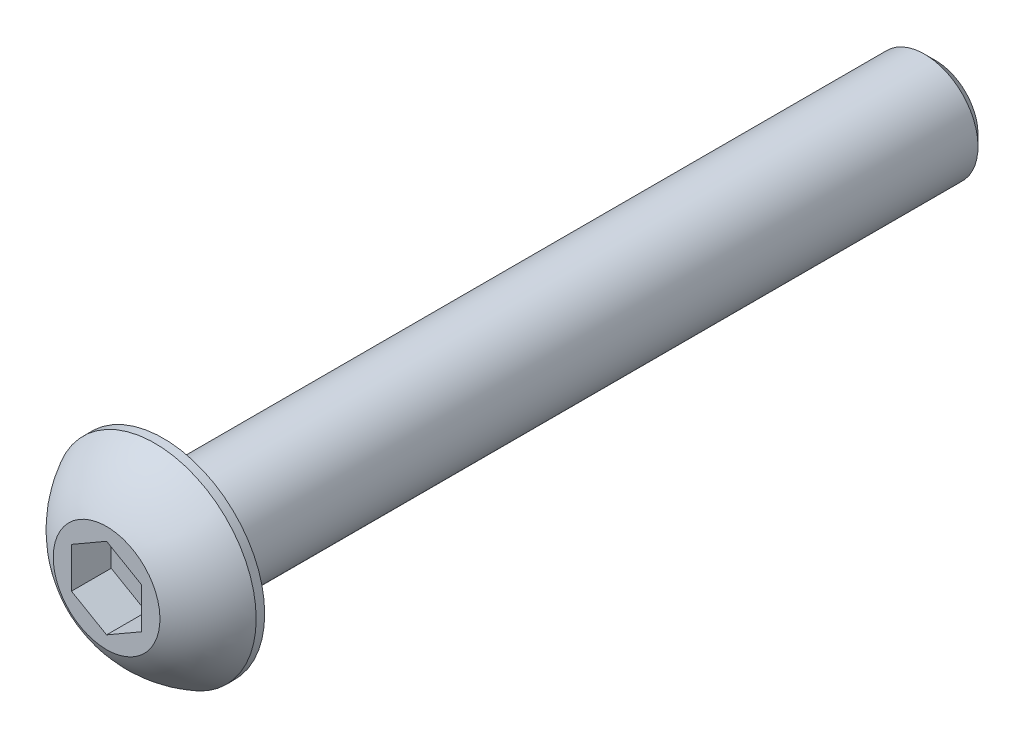
ISO-10303-21;
HEADER;
FILE_DESCRIPTION(('STEP AP214'),'2;1');
FILE_NAME('part.step','',(''),(''),'','','');
FILE_SCHEMA(('AUTOMOTIVE_DESIGN { 1 0 10303 214 1 1 1 1 }'));
ENDSEC;
DATA;
#1=APPLICATION_CONTEXT('core data for automotive mechanical design processes');
#2=APPLICATION_PROTOCOL_DEFINITION('international standard','automotive_design',2000,#1);
#3=PRODUCT_CONTEXT('',#1,'mechanical');
#4=PRODUCT('Part','Part','',(#3));
#5=PRODUCT_RELATED_PRODUCT_CATEGORY('part','',(#4));
#6=PRODUCT_DEFINITION_FORMATION('','',#4);
#7=PRODUCT_DEFINITION_CONTEXT('part definition',#1,'design');
#8=PRODUCT_DEFINITION('design','',#6,#7);
#9=PRODUCT_DEFINITION_SHAPE('','',#8);
#10=(LENGTH_UNIT() NAMED_UNIT(*) SI_UNIT(.MILLI.,.METRE.));
#11=(NAMED_UNIT(*) PLANE_ANGLE_UNIT() SI_UNIT($,.RADIAN.));
#12=(NAMED_UNIT(*) SI_UNIT($,.STERADIAN.) SOLID_ANGLE_UNIT());
#13=UNCERTAINTY_MEASURE_WITH_UNIT(LENGTH_MEASURE(1.E-05),#10,'distance_accuracy_value','');
#14=(GEOMETRIC_REPRESENTATION_CONTEXT(3) GLOBAL_UNCERTAINTY_ASSIGNED_CONTEXT((#13)) GLOBAL_UNIT_ASSIGNED_CONTEXT((#10,
#11,#12)) REPRESENTATION_CONTEXT('',''));
#15=CARTESIAN_POINT('',(0.,0.,0.));
#16=DIRECTION('',(0.,0.,1.));
#17=DIRECTION('',(1.,0.,0.));
#18=AXIS2_PLACEMENT_3D('',#15,#16,#17);
#19=CARTESIAN_POINT('',(0.,0.,-4.57488061444379));
#20=DIRECTION('',(0.,0.,1.));
#21=DIRECTION('',(0.,-1.,0.));
#22=AXIS2_PLACEMENT_3D('',#19,#20,#21);
#23=SPHERICAL_SURFACE('',#22,5.17224338526463);
#24=CARTESIAN_POINT('',(0.,0.,0.));
#25=DIRECTION('',(0.,0.,1.));
#26=DIRECTION('',(1.,0.,0.));
#27=AXIS2_PLACEMENT_3D('',#24,#25,#26);
#28=CIRCLE('',#27,2.41300000000001);
#29=CARTESIAN_POINT('',(0.,-2.41300000000001,0.));
#30=VERTEX_POINT('',#29);
#31=EDGE_CURVE('E12',#30,#30,#28,.T.);
#32=CARTESIAN_POINT('',(0.,0.,-2.18059));
#33=DIRECTION('',(0.,0.,1.));
#34=DIRECTION('',(1.,0.,0.));
#35=AXIS2_PLACEMENT_3D('',#32,#33,#34);
#36=CIRCLE('',#35,4.5847);
#37=CARTESIAN_POINT('',(0.,-4.5847,-2.18059));
#38=VERTEX_POINT('',#37);
#39=EDGE_CURVE('E150',#38,#38,#36,.T.);
#40=CARTESIAN_POINT('',(0.,-2.41300000000001,0.));
#41=CARTESIAN_POINT('',(0.,-2.44179113663083,-0.0151857097788006));
#42=CARTESIAN_POINT('',(0.,-2.47043888331475,-0.0306432741933341));
#43=CARTESIAN_POINT('',(0.,-2.52743746903511,-0.0620964513369402));
#44=CARTESIAN_POINT('',(0.,-2.55578830807156,-0.0780920640660127));
#45=CARTESIAN_POINT('',(0.,-2.61218295074332,-0.110615676881771));
#46=CARTESIAN_POINT('',(0.,-2.64022675437863,-0.127143676968458));
#47=CARTESIAN_POINT('',(0.,-2.69599733629139,-0.160726162390166));
#48=CARTESIAN_POINT('',(0.,-2.72372411456883,-0.177780647725189));
#49=CARTESIAN_POINT('',(0.,-2.77885076121155,-0.212410027642939));
#50=CARTESIAN_POINT('',(0.,-2.80625062957683,-0.229984922225668));
#51=CARTESIAN_POINT('',(0.,-2.86071369040083,-0.265648855453746));
#52=CARTESIAN_POINT('',(0.,-2.88777688285955,-0.283737894099096));
#53=CARTESIAN_POINT('',(0.,-2.94155694533547,-0.320423667994127));
#54=CARTESIAN_POINT('',(0.,-2.96827381535266,-0.339020403243808));
#55=CARTESIAN_POINT('',(0.,-3.0213517100001,-0.37671494166065));
#56=CARTESIAN_POINT('',(0.,-3.04771273463033,-0.39581274482781));
#57=CARTESIAN_POINT('',(0.,-3.10006954235699,-0.434502611862808));
#58=CARTESIAN_POINT('',(0.,-3.12606532545341,-0.454094675730644));
#59=CARTESIAN_POINT('',(0.,-3.17768238416297,-0.493766080756604));
#60=CARTESIAN_POINT('',(0.,-3.2033036597761,-0.513845421914727));
#61=CARTESIAN_POINT('',(0.,-3.25416257105645,-0.554484224430573));
#62=CARTESIAN_POINT('',(0.,-3.27940020672367,-0.575043685788297));
#63=CARTESIAN_POINT('',(0.,-3.32948284239518,-0.616635400476975));
#64=CARTESIAN_POINT('',(0.,-3.35432784239946,-0.63766765380793));
#65=CARTESIAN_POINT('',(0.,-3.40361635097914,-0.680197455694829));
#66=CARTESIAN_POINT('',(0.,-3.42805985955453,-0.701695004250773));
#67=CARTESIAN_POINT('',(0.,-3.47653667261837,-0.745147733989217));
#68=CARTESIAN_POINT('',(0.,-3.50056997710681,-0.767102915171717));
#69=CARTESIAN_POINT('',(0.,-3.54821781555203,-0.81146308444603));
#70=CARTESIAN_POINT('',(0.,-3.57183234950882,-0.833868072537844));
#71=CARTESIAN_POINT('',(0.,-3.61863422971284,-0.879119869584106));
#72=CARTESIAN_POINT('',(0.,-3.64182157596008,-0.901966678538555));
#73=CARTESIAN_POINT('',(0.,-3.68776081583416,-0.948093973780533));
#74=CARTESIAN_POINT('',(0.,-3.71051270946099,-0.971374460068062));
#75=CARTESIAN_POINT('',(0.,-3.75557293439636,-1.01836081186645));
#76=CARTESIAN_POINT('',(0.,-3.7778812657049,-1.0420666773773));
#77=CARTESIAN_POINT('',(0.,-3.82204641440941,-1.08989533789019));
#78=CARTESIAN_POINT('',(0.,-3.84390323180539,-1.11401813289221));
#79=CARTESIAN_POINT('',(0.,-3.88715756202836,-1.16267205404467));
#80=CARTESIAN_POINT('',(0.,-3.90855507485536,-1.18720318019511));
#81=CARTESIAN_POINT('',(0.,-3.95088316899876,-1.23666501975588));
#82=CARTESIAN_POINT('',(0.,-3.97181375031515,-1.26159573316622));
#83=CARTESIAN_POINT('',(0.,-4.01320052092912,-1.31184786092909));
#84=CARTESIAN_POINT('',(0.,-4.03365671022669,-1.33716927528163));
#85=CARTESIAN_POINT('',(0.,-4.07408740538699,-1.38819377934977));
#86=CARTESIAN_POINT('',(0.,-4.09406191124973,-1.41389686906536));
#87=CARTESIAN_POINT('',(0.,-4.13352211981722,-1.46567556223513));
#88=CARTESIAN_POINT('',(0.,-4.15300782252199,-1.4917511656893));
#89=CARTESIAN_POINT('',(0.,-4.19148347927458,-1.54426559193551));
#90=CARTESIAN_POINT('',(0.,-4.2104734333224,-1.57070441472756));
#91=CARTESIAN_POINT('',(0.,-4.24795082398615,-1.6239358557723));
#92=CARTESIAN_POINT('',(0.,-4.26643826060207,-1.65072847402499));
#93=CARTESIAN_POINT('',(0.,-4.30290402667351,-1.70465795604563));
#94=CARTESIAN_POINT('',(0.,-4.32088235612901,-1.73179481981358));
#95=CARTESIAN_POINT('',(0.,-4.35632349988304,-1.78640312007115));
#96=CARTESIAN_POINT('',(0.,-4.37378631418156,-1.81387455656079));
#97=CARTESIAN_POINT('',(0.,-4.40819020238474,-1.86914221075438));
#98=CARTESIAN_POINT('',(0.,-4.42513127628939,-1.89693842845834));
#99=CARTESIAN_POINT('',(0.,-4.45848564813517,-1.95284573578717));
#100=CARTESIAN_POINT('',(0.,-4.4748989460763,-1.98095682541204));
#101=CARTESIAN_POINT('',(0.,-4.50719190474587,-2.03748386259806));
#102=CARTESIAN_POINT('',(0.,-4.5230715654743,-2.06589981015923));
#103=CARTESIAN_POINT('',(0.,-4.55429163018258,-2.12302641242262));
#104=CARTESIAN_POINT('',(0.,-4.56963203416241,-2.15173706712485));
#105=CARTESIAN_POINT('',(0.,-4.5847,-2.18059));
#106=B_SPLINE_CURVE_WITH_KNOTS('',3,(#40,#41,#42,#43,#44,#45,#46,#47,#48,#49,#50,#51,#52,#53,
#54,#55,#56,#57,#58,#59,#60,#61,#62,#63,#64,#65,#66,#67,#68,#69,#70,#71,#72,#73,#74,#75,#76,#77,
#78,#79,#80,#81,#82,#83,#84,#85,#86,#87,#88,#89,#90,#91,#92,#93,#94,#95,#96,#97,#98,#99,#100,
#101,#102,#103,#104,#105),.UNSPECIFIED.,.F.,.F.,(4,2,2,2,2,2,2,2,2,2,2,2,2,2,2,2,2,2,2,2,2,2,2,
2,2,2,2,2,2,2,2,2,4),(0.,0.0976500604051494,0.195300120810298,0.292950181215448,
0.390600241620597,0.488250302025746,0.585900362430895,0.683550422836045,0.781200483241193,
0.878850543646342,0.976500604051491,1.07415066445664,1.17180072486179,1.26945078526694,
1.36710084567209,1.46475090607724,1.56240096648239,1.66005102688754,1.75770108729268,
1.85535114769783,1.95300120810298,2.05065126850813,2.14830132891328,2.24595138931843,
2.34360144972358,2.44125151012873,2.53890157053388,2.63655163093903,2.73420169134418,
2.83185175174933,2.92950181215447,3.02715187255962,3.12480193296477),.UNSPECIFIED.);
#107=EDGE_CURVE('BSEAM49',#30,#38,#106,.T.);
#108=ORIENTED_EDGE('',*,*,#31,.F.);
#109=ORIENTED_EDGE('',*,*,#39,.T.);
#110=ORIENTED_EDGE('',*,*,#107,.T.);
#111=ORIENTED_EDGE('',*,*,#107,.F.);
#112=EDGE_LOOP('',(#108,#110,#109,#111));
#113=FACE_BOUND('',#112,.T.);
#114=ADVANCED_FACE('F49',(#113),#23,.T.);
#115=CARTESIAN_POINT('',(0.,-2.41300000000001,0.));
#116=DIRECTION('',(0.,0.,-1.));
#117=DIRECTION('',(-1.,0.,0.));
#118=AXIS2_PLACEMENT_3D('',#115,#116,#117);
#119=PLANE('',#118);
#120=DIRECTION('',(0.,1.,0.));
#121=VECTOR('',#120,1.);
#122=CARTESIAN_POINT('',(1.5875,-0.916543552338528,0.));
#123=LINE('',#122,#121);
#124=CARTESIAN_POINT('',(1.5875,-0.916543552338528,0.));
#125=VERTEX_POINT('',#124);
#126=CARTESIAN_POINT('',(1.5875,0.916543552338531,0.));
#127=VERTEX_POINT('',#126);
#128=EDGE_CURVE('E137',#125,#127,#123,.T.);
#129=ORIENTED_EDGE('',*,*,#128,.F.);
#130=DIRECTION('',(0.866025403784438,0.5,0.));
#131=VECTOR('',#130,1.);
#132=CARTESIAN_POINT('',(0.,-1.83308710467706,0.));
#133=LINE('',#132,#131);
#134=CARTESIAN_POINT('',(0.,-1.83308710467706,0.));
#135=VERTEX_POINT('',#134);
#136=EDGE_CURVE('E63',#135,#125,#133,.T.);
#137=ORIENTED_EDGE('',*,*,#136,.F.);
#138=DIRECTION('',(0.866025403784439,-0.5,0.));
#139=VECTOR('',#138,1.);
#140=CARTESIAN_POINT('',(-1.5875,-0.916543552338531,0.));
#141=LINE('',#140,#139);
#142=CARTESIAN_POINT('',(-1.5875,-0.916543552338531,0.));
#143=VERTEX_POINT('',#142);
#144=EDGE_CURVE('E146',#143,#135,#141,.T.);
#145=ORIENTED_EDGE('',*,*,#144,.F.);
#146=DIRECTION('',(0.,-1.,0.));
#147=VECTOR('',#146,1.);
#148=CARTESIAN_POINT('',(-1.5875,0.91654355233853,0.));
#149=LINE('',#148,#147);
#150=CARTESIAN_POINT('',(-1.5875,0.91654355233853,0.));
#151=VERTEX_POINT('',#150);
#152=EDGE_CURVE('E144',#151,#143,#149,.T.);
#153=ORIENTED_EDGE('',*,*,#152,.F.);
#154=DIRECTION('',(-0.866025403784439,-0.5,0.));
#155=VECTOR('',#154,1.);
#156=CARTESIAN_POINT('',(0.,1.83308710467706,0.));
#157=LINE('',#156,#155);
#158=CARTESIAN_POINT('',(0.,1.83308710467706,0.));
#159=VERTEX_POINT('',#158);
#160=EDGE_CURVE('E111',#159,#151,#157,.T.);
#161=ORIENTED_EDGE('',*,*,#160,.F.);
#162=DIRECTION('',(-0.866025403784439,0.5,0.));
#163=VECTOR('',#162,1.);
#164=CARTESIAN_POINT('',(1.5875,0.916543552338531,0.));
#165=LINE('',#164,#163);
#166=EDGE_CURVE('E140',#127,#159,#165,.T.);
#167=ORIENTED_EDGE('',*,*,#166,.F.);
#168=EDGE_LOOP('',(#129,#137,#145,#153,#161,#167));
#169=FACE_BOUND('',#168,.T.);
#170=ORIENTED_EDGE('',*,*,#31,.T.);
#171=EDGE_LOOP('',(#170));
#172=FACE_BOUND('',#171,.T.);
#173=ADVANCED_FACE('F164',(#169,#172),#119,.F.);
#174=CARTESIAN_POINT('',(0.,-4.5847,-2.5654));
#175=DIRECTION('',(0.,0.,1.));
#176=DIRECTION('',(1.,0.,0.));
#177=AXIS2_PLACEMENT_3D('',#174,#175,#176);
#178=PLANE('',#177);
#179=CARTESIAN_POINT('',(0.,0.,-2.5654));
#180=DIRECTION('',(0.,0.,1.));
#181=DIRECTION('',(1.,0.,0.));
#182=AXIS2_PLACEMENT_3D('',#179,#180,#181);
#183=CIRCLE('',#182,4.5847);
#184=CARTESIAN_POINT('',(4.5847,0.,-2.5654));
#185=VERTEX_POINT('',#184);
#186=EDGE_CURVE('E56',#185,#185,#183,.T.);
#187=ORIENTED_EDGE('',*,*,#186,.F.);
#188=EDGE_LOOP('',(#187));
#189=FACE_BOUND('',#188,.T.);
#190=ADVANCED_FACE('F162',(#189),#178,.F.);
#191=CARTESIAN_POINT('',(0.,0.,0.));
#192=DIRECTION('',(0.,0.,1.));
#193=DIRECTION('',(1.,0.,0.));
#194=AXIS2_PLACEMENT_3D('',#191,#192,#193);
#195=CYLINDRICAL_SURFACE('',#194,4.5847);
#196=ORIENTED_EDGE('',*,*,#39,.F.);
#197=EDGE_LOOP('',(#196));
#198=FACE_BOUND('',#197,.T.);
#199=ORIENTED_EDGE('',*,*,#186,.T.);
#200=EDGE_LOOP('',(#199));
#201=FACE_BOUND('',#200,.T.);
#202=ADVANCED_FACE('F160',(#198,#201),#195,.T.);
#203=CARTESIAN_POINT('',(0.,-1.83308710467706,-1.79578));
#204=DIRECTION('',(0.5,-0.866025403784438,0.));
#205=DIRECTION('',(0.866025403784438,0.5,0.));
#206=AXIS2_PLACEMENT_3D('',#203,#204,#205);
#207=PLANE('',#206);
#208=ORIENTED_EDGE('',*,*,#136,.T.);
#209=DIRECTION('',(0.,0.,1.));
#210=VECTOR('',#209,1.);
#211=CARTESIAN_POINT('',(1.5875,-0.916543552338528,-1.79578));
#212=LINE('',#211,#210);
#213=CARTESIAN_POINT('',(1.5875,-0.916543552338528,-1.79578));
#214=VERTEX_POINT('',#213);
#215=EDGE_CURVE('E93',#214,#125,#212,.T.);
#216=ORIENTED_EDGE('',*,*,#215,.F.);
#217=DIRECTION('',(0.866025403784438,0.5,0.));
#218=VECTOR('',#217,1.);
#219=CARTESIAN_POINT('',(0.,-1.83308710467706,-1.79578));
#220=LINE('',#219,#218);
#221=CARTESIAN_POINT('',(0.,-1.83308710467706,-1.79578));
#222=VERTEX_POINT('',#221);
#223=EDGE_CURVE('E148',#222,#214,#220,.T.);
#224=ORIENTED_EDGE('',*,*,#223,.F.);
#225=DIRECTION('',(0.,0.,1.));
#226=VECTOR('',#225,1.);
#227=CARTESIAN_POINT('',(0.,-1.83308710467706,-1.79578));
#228=LINE('',#227,#226);
#229=EDGE_CURVE('E71',#222,#135,#228,.T.);
#230=ORIENTED_EDGE('',*,*,#229,.T.);
#231=EDGE_LOOP('',(#208,#216,#224,#230));
#232=FACE_BOUND('',#231,.T.);
#233=ADVANCED_FACE('F170',(#232),#207,.F.);
#234=CARTESIAN_POINT('',(-1.5875,-0.916543552338531,-1.79578));
#235=DIRECTION('',(-0.5,-0.866025403784439,0.));
#236=DIRECTION('',(0.866025403784439,-0.5,0.));
#237=AXIS2_PLACEMENT_3D('',#234,#235,#236);
#238=PLANE('',#237);
#239=ORIENTED_EDGE('',*,*,#144,.T.);
#240=ORIENTED_EDGE('',*,*,#229,.F.);
#241=DIRECTION('',(0.866025403784439,-0.5,0.));
#242=VECTOR('',#241,1.);
#243=CARTESIAN_POINT('',(-1.5875,-0.916543552338531,-1.79578));
#244=LINE('',#243,#242);
#245=CARTESIAN_POINT('',(-1.5875,-0.916543552338531,-1.79578));
#246=VERTEX_POINT('',#245);
#247=EDGE_CURVE('E123',#246,#222,#244,.T.);
#248=ORIENTED_EDGE('',*,*,#247,.F.);
#249=DIRECTION('',(0.,0.,1.));
#250=VECTOR('',#249,1.);
#251=CARTESIAN_POINT('',(-1.5875,-0.916543552338531,-1.79578));
#252=LINE('',#251,#250);
#253=EDGE_CURVE('E115',#246,#143,#252,.T.);
#254=ORIENTED_EDGE('',*,*,#253,.T.);
#255=EDGE_LOOP('',(#239,#240,#248,#254));
#256=FACE_BOUND('',#255,.T.);
#257=ADVANCED_FACE('F199',(#256),#238,.F.);
#258=CARTESIAN_POINT('',(-1.5875,0.91654355233853,-1.79578));
#259=DIRECTION('',(-1.,0.,0.));
#260=DIRECTION('',(0.,-1.,0.));
#261=AXIS2_PLACEMENT_3D('',#258,#259,#260);
#262=PLANE('',#261);
#263=ORIENTED_EDGE('',*,*,#152,.T.);
#264=ORIENTED_EDGE('',*,*,#253,.F.);
#265=DIRECTION('',(0.,-1.,0.));
#266=VECTOR('',#265,1.);
#267=CARTESIAN_POINT('',(-1.5875,0.91654355233853,-1.79578));
#268=LINE('',#267,#266);
#269=CARTESIAN_POINT('',(-1.5875,0.91654355233853,-1.79578));
#270=VERTEX_POINT('',#269);
#271=EDGE_CURVE('E119',#270,#246,#268,.T.);
#272=ORIENTED_EDGE('',*,*,#271,.F.);
#273=DIRECTION('',(0.,0.,1.));
#274=VECTOR('',#273,1.);
#275=CARTESIAN_POINT('',(-1.5875,0.91654355233853,-1.79578));
#276=LINE('',#275,#274);
#277=EDGE_CURVE('E104',#270,#151,#276,.T.);
#278=ORIENTED_EDGE('',*,*,#277,.T.);
#279=EDGE_LOOP('',(#263,#264,#272,#278));
#280=FACE_BOUND('',#279,.T.);
#281=ADVANCED_FACE('F120',(#280),#262,.F.);
#282=CARTESIAN_POINT('',(0.,1.83308710467706,-1.79578));
#283=DIRECTION('',(-0.5,0.866025403784439,0.));
#284=DIRECTION('',(-0.866025403784439,-0.5,0.));
#285=AXIS2_PLACEMENT_3D('',#282,#283,#284);
#286=PLANE('',#285);
#287=ORIENTED_EDGE('',*,*,#160,.T.);
#288=ORIENTED_EDGE('',*,*,#277,.F.);
#289=DIRECTION('',(-0.866025403784439,-0.5,0.));
#290=VECTOR('',#289,1.);
#291=CARTESIAN_POINT('',(0.,1.83308710467706,-1.79578));
#292=LINE('',#291,#290);
#293=CARTESIAN_POINT('',(0.,1.83308710467706,-1.79578));
#294=VERTEX_POINT('',#293);
#295=EDGE_CURVE('E108',#294,#270,#292,.T.);
#296=ORIENTED_EDGE('',*,*,#295,.F.);
#297=DIRECTION('',(0.,0.,1.));
#298=VECTOR('',#297,1.);
#299=CARTESIAN_POINT('',(0.,1.83308710467706,-1.79578));
#300=LINE('',#299,#298);
#301=EDGE_CURVE('E116',#294,#159,#300,.T.);
#302=ORIENTED_EDGE('',*,*,#301,.T.);
#303=EDGE_LOOP('',(#287,#288,#296,#302));
#304=FACE_BOUND('',#303,.T.);
#305=ADVANCED_FACE('F106',(#304),#286,.F.);
#306=CARTESIAN_POINT('',(1.5875,0.916543552338531,-1.79578));
#307=DIRECTION('',(0.5,0.866025403784439,0.));
#308=DIRECTION('',(-0.866025403784439,0.5,0.));
#309=AXIS2_PLACEMENT_3D('',#306,#307,#308);
#310=PLANE('',#309);
#311=ORIENTED_EDGE('',*,*,#166,.T.);
#312=ORIENTED_EDGE('',*,*,#301,.F.);
#313=DIRECTION('',(-0.866025403784439,0.5,0.));
#314=VECTOR('',#313,1.);
#315=CARTESIAN_POINT('',(1.5875,0.916543552338531,-1.79578));
#316=LINE('',#315,#314);
#317=CARTESIAN_POINT('',(1.5875,0.916543552338531,-1.79578));
#318=VERTEX_POINT('',#317);
#319=EDGE_CURVE('E129',#318,#294,#316,.T.);
#320=ORIENTED_EDGE('',*,*,#319,.F.);
#321=DIRECTION('',(0.,0.,1.));
#322=VECTOR('',#321,1.);
#323=CARTESIAN_POINT('',(1.5875,0.916543552338531,-1.79578));
#324=LINE('',#323,#322);
#325=EDGE_CURVE('E153',#318,#127,#324,.T.);
#326=ORIENTED_EDGE('',*,*,#325,.T.);
#327=EDGE_LOOP('',(#311,#312,#320,#326));
#328=FACE_BOUND('',#327,.T.);
#329=ADVANCED_FACE('F224',(#328),#310,.F.);
#330=CARTESIAN_POINT('',(1.5875,-0.916543552338528,-1.79578));
#331=DIRECTION('',(1.,0.,0.));
#332=DIRECTION('',(0.,1.,0.));
#333=AXIS2_PLACEMENT_3D('',#330,#331,#332);
#334=PLANE('',#333);
#335=ORIENTED_EDGE('',*,*,#128,.T.);
#336=ORIENTED_EDGE('',*,*,#325,.F.);
#337=DIRECTION('',(0.,1.,0.));
#338=VECTOR('',#337,1.);
#339=CARTESIAN_POINT('',(1.5875,-0.916543552338528,-1.79578));
#340=LINE('',#339,#338);
#341=EDGE_CURVE('E131',#214,#318,#340,.T.);
#342=ORIENTED_EDGE('',*,*,#341,.F.);
#343=ORIENTED_EDGE('',*,*,#215,.T.);
#344=EDGE_LOOP('',(#335,#336,#342,#343));
#345=FACE_BOUND('',#344,.T.);
#346=ADVANCED_FACE('F233',(#345),#334,.F.);
#347=CARTESIAN_POINT('',(1.5875,-0.916543552338528,-1.79578));
#348=DIRECTION('',(0.,0.,1.));
#349=DIRECTION('',(1.,0.,0.));
#350=AXIS2_PLACEMENT_3D('',#347,#348,#349);
#351=PLANE('',#350);
#352=ORIENTED_EDGE('',*,*,#223,.T.);
#353=ORIENTED_EDGE('',*,*,#341,.T.);
#354=ORIENTED_EDGE('',*,*,#319,.T.);
#355=ORIENTED_EDGE('',*,*,#295,.T.);
#356=ORIENTED_EDGE('',*,*,#271,.T.);
#357=ORIENTED_EDGE('',*,*,#247,.T.);
#358=EDGE_LOOP('',(#352,#353,#354,#355,#356,#357));
#359=FACE_BOUND('',#358,.T.);
#360=ADVANCED_FACE('F126',(#359),#351,.T.);
#361=CLOSED_SHELL('',(#114,#173,#190,#202,#233,#257,#281,#305,#329,#346,#360));
#362=MANIFOLD_SOLID_BREP('B2',#361);
#363=CARTESIAN_POINT('',(0.,2.41300000000001,-37.4904));
#364=DIRECTION('',(0.,0.,1.));
#365=DIRECTION('',(0.,-1.,0.));
#366=AXIS2_PLACEMENT_3D('',#363,#364,#365);
#367=PLANE('',#366);
#368=CARTESIAN_POINT('',(0.,0.,-37.4904));
#369=DIRECTION('',(0.,0.,1.));
#370=DIRECTION('',(0.,-1.,0.));
#371=AXIS2_PLACEMENT_3D('',#368,#369,#370);
#372=CIRCLE('',#371,1.91690625000002);
#373=CARTESIAN_POINT('',(0.,-1.91690625000003,-37.4904));
#374=VERTEX_POINT('',#373);
#375=EDGE_CURVE('E48',#374,#374,#372,.F.);
#376=ORIENTED_EDGE('',*,*,#375,.T.);
#377=EDGE_LOOP('',(#376));
#378=FACE_BOUND('',#377,.T.);
#379=ADVANCED_FACE('F270',(#378),#367,.F.);
#380=CARTESIAN_POINT('',(0.,0.,-2.5654));
#381=DIRECTION('',(0.,0.,1.));
#382=DIRECTION('',(0.,-1.,0.));
#383=AXIS2_PLACEMENT_3D('',#380,#381,#382);
#384=CYLINDRICAL_SURFACE('',#383,2.41300000000001);
#385=CARTESIAN_POINT('',(0.,0.,-36.99430625));
#386=DIRECTION('',(0.,0.,1.));
#387=DIRECTION('',(0.,-1.,0.));
#388=AXIS2_PLACEMENT_3D('',#385,#386,#387);
#389=CIRCLE('',#388,2.41300000000001);
#390=CARTESIAN_POINT('',(0.,-2.41300000000002,-36.99430625));
#391=VERTEX_POINT('',#390);
#392=EDGE_CURVE('E278',#391,#391,#389,.T.);
#393=ORIENTED_EDGE('',*,*,#392,.T.);
#394=EDGE_LOOP('',(#393));
#395=FACE_BOUND('',#394,.T.);
#396=CARTESIAN_POINT('',(0.,0.,-2.5654));
#397=DIRECTION('',(0.,0.,1.));
#398=DIRECTION('',(0.,-1.,0.));
#399=AXIS2_PLACEMENT_3D('',#396,#397,#398);
#400=CIRCLE('',#399,2.41300000000001);
#401=CARTESIAN_POINT('',(0.,-2.41300000000001,-2.5654));
#402=VERTEX_POINT('',#401);
#403=EDGE_CURVE('E283',#402,#402,#400,.T.);
#404=ORIENTED_EDGE('',*,*,#403,.F.);
#405=EDGE_LOOP('',(#404));
#406=FACE_BOUND('',#405,.T.);
#407=ADVANCED_FACE('F293',(#395,#406),#384,.T.);
#408=CARTESIAN_POINT('',(0.,2.41300000000001,-2.5654));
#409=DIRECTION('',(0.,0.,-1.));
#410=DIRECTION('',(0.,1.,0.));
#411=AXIS2_PLACEMENT_3D('',#408,#409,#410);
#412=PLANE('',#411);
#413=ORIENTED_EDGE('',*,*,#403,.T.);
#414=EDGE_LOOP('',(#413));
#415=FACE_BOUND('',#414,.T.);
#416=ADVANCED_FACE('F291',(#415),#412,.F.);
#417=CARTESIAN_POINT('',(0.,0.,-36.99430625));
#418=DIRECTION('',(0.,0.,1.));
#419=DIRECTION('',(0.,-1.,0.));
#420=AXIS2_PLACEMENT_3D('',#417,#418,#419);
#421=CONICAL_SURFACE('',#420,2.41300000000001,0.785398163397449);
#422=ORIENTED_EDGE('',*,*,#375,.F.);
#423=EDGE_LOOP('',(#422));
#424=FACE_BOUND('',#423,.T.);
#425=ORIENTED_EDGE('',*,*,#392,.F.);
#426=EDGE_LOOP('',(#425));
#427=FACE_BOUND('',#426,.T.);
#428=ADVANCED_FACE('F272',(#424,#427),#421,.T.);
#429=CLOSED_SHELL('',(#379,#407,#416,#428));
#430=MANIFOLD_SOLID_BREP('B6',#429);
#431=ADVANCED_BREP_SHAPE_REPRESENTATION('',(#18,#362,#430),#14);
#432=SHAPE_DEFINITION_REPRESENTATION(#9,#431);
ENDSEC;
END-ISO-10303-21;
